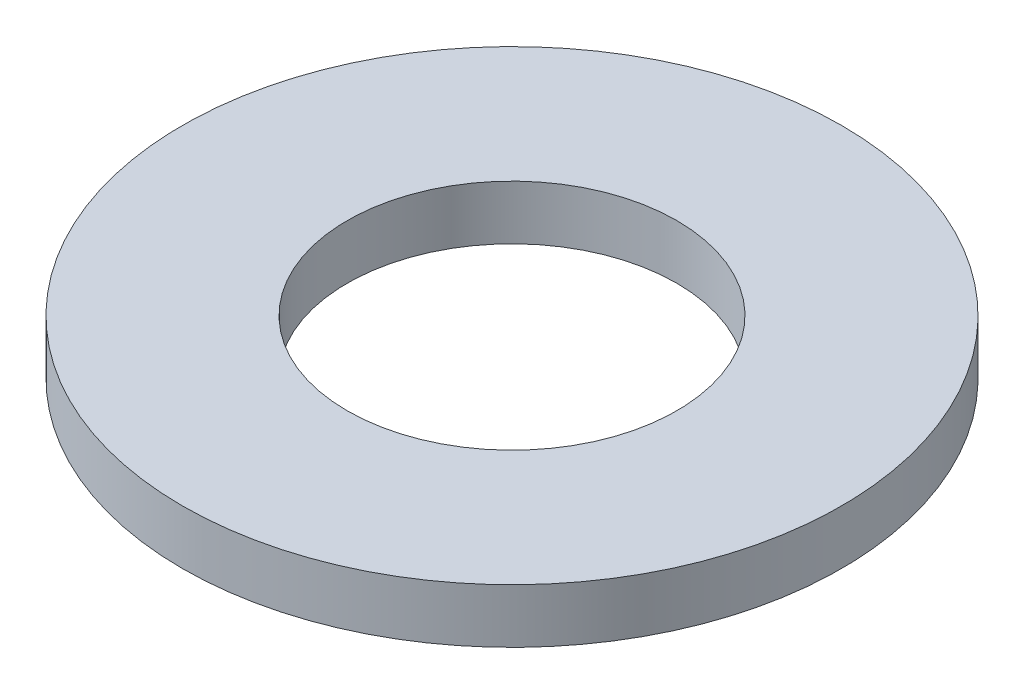
ISO-10303-21;
HEADER;
FILE_DESCRIPTION(('STEP AP214'),'2;1');
FILE_NAME('part.step','',(''),(''),'','','');
FILE_SCHEMA(('AUTOMOTIVE_DESIGN { 1 0 10303 214 1 1 1 1 }'));
ENDSEC;
DATA;
#1=APPLICATION_CONTEXT('core data for automotive mechanical design processes');
#2=APPLICATION_PROTOCOL_DEFINITION('international standard','automotive_design',2000,#1);
#3=PRODUCT_CONTEXT('',#1,'mechanical');
#4=PRODUCT('Part','Part','',(#3));
#5=PRODUCT_RELATED_PRODUCT_CATEGORY('part','',(#4));
#6=PRODUCT_DEFINITION_FORMATION('','',#4);
#7=PRODUCT_DEFINITION_CONTEXT('part definition',#1,'design');
#8=PRODUCT_DEFINITION('design','',#6,#7);
#9=PRODUCT_DEFINITION_SHAPE('','',#8);
#10=(LENGTH_UNIT() NAMED_UNIT(*) SI_UNIT(.MILLI.,.METRE.));
#11=(NAMED_UNIT(*) PLANE_ANGLE_UNIT() SI_UNIT($,.RADIAN.));
#12=(NAMED_UNIT(*) SI_UNIT($,.STERADIAN.) SOLID_ANGLE_UNIT());
#13=UNCERTAINTY_MEASURE_WITH_UNIT(LENGTH_MEASURE(1.E-05),#10,'distance_accuracy_value','');
#14=(GEOMETRIC_REPRESENTATION_CONTEXT(3) GLOBAL_UNCERTAINTY_ASSIGNED_CONTEXT((#13)) GLOBAL_UNIT_ASSIGNED_CONTEXT((#10,
#11,#12)) REPRESENTATION_CONTEXT('',''));
#15=CARTESIAN_POINT('',(0.,0.,0.));
#16=DIRECTION('',(0.,0.,1.));
#17=DIRECTION('',(1.,0.,0.));
#18=AXIS2_PLACEMENT_3D('',#15,#16,#17);
#19=CARTESIAN_POINT('',(0.,14.,0.));
#20=DIRECTION('',(0.,-1.,0.));
#21=DIRECTION('',(0.,0.,-1.));
#22=AXIS2_PLACEMENT_3D('',#19,#20,#21);
#23=CYLINDRICAL_SURFACE('',#22,85.);
#24=CARTESIAN_POINT('',(0.,14.,0.));
#25=DIRECTION('',(0.,1.,0.));
#26=DIRECTION('',(0.,0.,1.));
#27=AXIS2_PLACEMENT_3D('',#24,#25,#26);
#28=CIRCLE('',#27,85.);
#29=CARTESIAN_POINT('',(0.,14.,85.));
#30=VERTEX_POINT('',#29);
#31=EDGE_CURVE('E10',#30,#30,#28,.T.);
#32=ORIENTED_EDGE('',*,*,#31,.F.);
#33=EDGE_LOOP('',(#32));
#34=FACE_BOUND('',#33,.T.);
#35=CARTESIAN_POINT('',(0.,0.,0.));
#36=DIRECTION('',(0.,1.,0.));
#37=DIRECTION('',(0.,0.,1.));
#38=AXIS2_PLACEMENT_3D('',#35,#36,#37);
#39=CIRCLE('',#38,85.);
#40=CARTESIAN_POINT('',(0.,0.,85.));
#41=VERTEX_POINT('',#40);
#42=EDGE_CURVE('E37',#41,#41,#39,.T.);
#43=ORIENTED_EDGE('',*,*,#42,.T.);
#44=EDGE_LOOP('',(#43));
#45=FACE_BOUND('',#44,.T.);
#46=ADVANCED_FACE('F40',(#34,#45),#23,.T.);
#47=CARTESIAN_POINT('',(0.,14.,0.));
#48=DIRECTION('',(0.,1.,0.));
#49=DIRECTION('',(0.,0.,1.));
#50=AXIS2_PLACEMENT_3D('',#47,#48,#49);
#51=PLANE('',#50);
#52=CARTESIAN_POINT('',(0.,14.,0.));
#53=DIRECTION('',(0.,1.,0.));
#54=DIRECTION('',(0.,0.,1.));
#55=AXIS2_PLACEMENT_3D('',#52,#53,#54);
#56=CIRCLE('',#55,42.5);
#57=CARTESIAN_POINT('',(0.,14.,42.5));
#58=VERTEX_POINT('',#57);
#59=EDGE_CURVE('E50',#58,#58,#56,.T.);
#60=ORIENTED_EDGE('',*,*,#59,.F.);
#61=EDGE_LOOP('',(#60));
#62=FACE_BOUND('',#61,.T.);
#63=ORIENTED_EDGE('',*,*,#31,.T.);
#64=EDGE_LOOP('',(#63));
#65=FACE_BOUND('',#64,.T.);
#66=ADVANCED_FACE('F59',(#62,#65),#51,.T.);
#67=CARTESIAN_POINT('',(0.,0.,0.));
#68=DIRECTION('',(0.,1.,0.));
#69=DIRECTION('',(0.,0.,1.));
#70=AXIS2_PLACEMENT_3D('',#67,#68,#69);
#71=PLANE('',#70);
#72=CARTESIAN_POINT('',(0.,0.,0.));
#73=DIRECTION('',(0.,1.,0.));
#74=DIRECTION('',(0.,0.,1.));
#75=AXIS2_PLACEMENT_3D('',#72,#73,#74);
#76=CIRCLE('',#75,42.5);
#77=CARTESIAN_POINT('',(0.,0.,42.5));
#78=VERTEX_POINT('',#77);
#79=EDGE_CURVE('E47',#78,#78,#76,.T.);
#80=ORIENTED_EDGE('',*,*,#79,.T.);
#81=EDGE_LOOP('',(#80));
#82=FACE_BOUND('',#81,.T.);
#83=ORIENTED_EDGE('',*,*,#42,.F.);
#84=EDGE_LOOP('',(#83));
#85=FACE_BOUND('',#84,.T.);
#86=ADVANCED_FACE('F58',(#82,#85),#71,.F.);
#87=CARTESIAN_POINT('',(0.,14.,0.));
#88=DIRECTION('',(0.,-1.,0.));
#89=DIRECTION('',(0.,0.,-1.));
#90=AXIS2_PLACEMENT_3D('',#87,#88,#89);
#91=CYLINDRICAL_SURFACE('',#90,42.5);
#92=ORIENTED_EDGE('',*,*,#59,.T.);
#93=EDGE_LOOP('',(#92));
#94=FACE_BOUND('',#93,.T.);
#95=ORIENTED_EDGE('',*,*,#79,.F.);
#96=EDGE_LOOP('',(#95));
#97=FACE_BOUND('',#96,.T.);
#98=ADVANCED_FACE('F54',(#94,#97),#91,.F.);
#99=CLOSED_SHELL('',(#46,#66,#86,#98));
#100=MANIFOLD_SOLID_BREP('B2',#99);
#101=ADVANCED_BREP_SHAPE_REPRESENTATION('',(#18,#100),#14);
#102=SHAPE_DEFINITION_REPRESENTATION(#9,#101);
ENDSEC;
END-ISO-10303-21;
